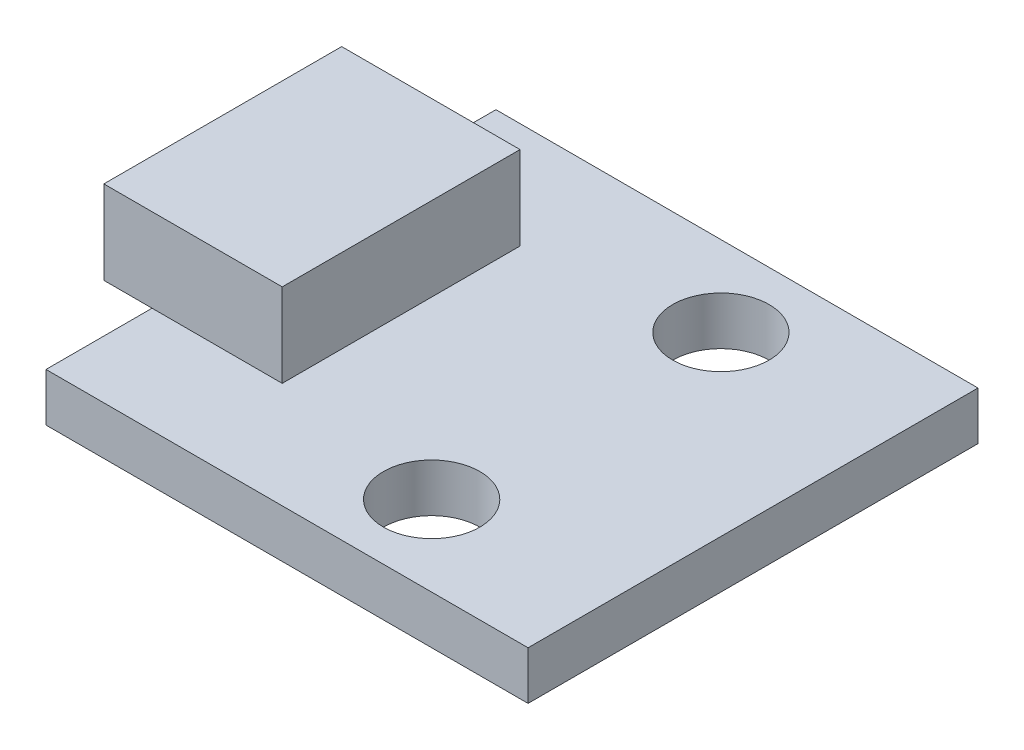
ISO-10303-21;
HEADER;
FILE_DESCRIPTION(('STEP AP214'),'2;1');
FILE_NAME('part.step','',(''),(''),'','','');
FILE_SCHEMA(('AUTOMOTIVE_DESIGN { 1 0 10303 214 1 1 1 1 }'));
ENDSEC;
DATA;
#1=APPLICATION_CONTEXT('core data for automotive mechanical design processes');
#2=APPLICATION_PROTOCOL_DEFINITION('international standard','automotive_design',2000,#1);
#3=PRODUCT_CONTEXT('',#1,'mechanical');
#4=PRODUCT('Part','Part','',(#3));
#5=PRODUCT_RELATED_PRODUCT_CATEGORY('part','',(#4));
#6=PRODUCT_DEFINITION_FORMATION('','',#4);
#7=PRODUCT_DEFINITION_CONTEXT('part definition',#1,'design');
#8=PRODUCT_DEFINITION('design','',#6,#7);
#9=PRODUCT_DEFINITION_SHAPE('','',#8);
#10=(LENGTH_UNIT() NAMED_UNIT(*) SI_UNIT(.MILLI.,.METRE.));
#11=(NAMED_UNIT(*) PLANE_ANGLE_UNIT() SI_UNIT($,.RADIAN.));
#12=(NAMED_UNIT(*) SI_UNIT($,.STERADIAN.) SOLID_ANGLE_UNIT());
#13=UNCERTAINTY_MEASURE_WITH_UNIT(LENGTH_MEASURE(1.E-05),#10,'distance_accuracy_value','');
#14=(GEOMETRIC_REPRESENTATION_CONTEXT(3) GLOBAL_UNCERTAINTY_ASSIGNED_CONTEXT((#13)) GLOBAL_UNIT_ASSIGNED_CONTEXT((#10,
#11,#12)) REPRESENTATION_CONTEXT('',''));
#15=CARTESIAN_POINT('',(0.,0.,0.));
#16=DIRECTION('',(0.,0.,1.));
#17=DIRECTION('',(1.,0.,0.));
#18=AXIS2_PLACEMENT_3D('',#15,#16,#17);
#19=CARTESIAN_POINT('',(0.,1.5,0.));
#20=DIRECTION('',(0.,1.,0.));
#21=DIRECTION('',(0.,0.,1.));
#22=AXIS2_PLACEMENT_3D('',#19,#20,#21);
#23=PLANE('',#22);
#24=CARTESIAN_POINT('',(2.,1.5,-4.5));
#25=DIRECTION('',(0.,1.,0.));
#26=DIRECTION('',(0.,0.,1.));
#27=AXIS2_PLACEMENT_3D('',#24,#25,#26);
#28=CIRCLE('',#27,1.5);
#29=CARTESIAN_POINT('',(2.,1.5,-3.));
#30=VERTEX_POINT('',#29);
#31=EDGE_CURVE('E208',#30,#30,#28,.T.);
#32=ORIENTED_EDGE('',*,*,#31,.F.);
#33=EDGE_LOOP('',(#32));
#34=FACE_BOUND('',#33,.T.);
#35=CARTESIAN_POINT('',(2.,1.5,4.5));
#36=DIRECTION('',(0.,1.,0.));
#37=DIRECTION('',(0.,0.,1.));
#38=AXIS2_PLACEMENT_3D('',#35,#36,#37);
#39=CIRCLE('',#38,1.5);
#40=CARTESIAN_POINT('',(2.,1.5,6.));
#41=VERTEX_POINT('',#40);
#42=EDGE_CURVE('E212',#41,#41,#39,.T.);
#43=ORIENTED_EDGE('',*,*,#42,.F.);
#44=EDGE_LOOP('',(#43));
#45=FACE_BOUND('',#44,.T.);
#46=DIRECTION('',(0.,0.,1.));
#47=VECTOR('',#46,1.);
#48=CARTESIAN_POINT('',(-7.5,1.5,0.));
#49=LINE('',#48,#47);
#50=CARTESIAN_POINT('',(-7.5,1.5,-7.));
#51=VERTEX_POINT('',#50);
#52=CARTESIAN_POINT('',(-7.5,1.5,-3.7));
#53=VERTEX_POINT('',#52);
#54=EDGE_CURVE('E196',#51,#53,#49,.T.);
#55=ORIENTED_EDGE('',*,*,#54,.T.);
#56=DIRECTION('',(1.,0.,0.));
#57=VECTOR('',#56,1.);
#58=CARTESIAN_POINT('',(0.,1.5,-3.7));
#59=LINE('',#58,#57);
#60=CARTESIAN_POINT('',(-3.45,1.5,-3.7));
#61=VERTEX_POINT('',#60);
#62=EDGE_CURVE('E12',#53,#61,#59,.T.);
#63=ORIENTED_EDGE('',*,*,#62,.T.);
#64=DIRECTION('',(0.,0.,-1.));
#65=VECTOR('',#64,1.);
#66=CARTESIAN_POINT('',(-3.45,1.5,0.));
#67=LINE('',#66,#65);
#68=CARTESIAN_POINT('',(-3.45,1.5,3.7));
#69=VERTEX_POINT('',#68);
#70=EDGE_CURVE('E152',#69,#61,#67,.T.);
#71=ORIENTED_EDGE('',*,*,#70,.F.);
#72=DIRECTION('',(1.,0.,0.));
#73=VECTOR('',#72,1.);
#74=CARTESIAN_POINT('',(0.,1.5,3.7));
#75=LINE('',#74,#73);
#76=CARTESIAN_POINT('',(-7.5,1.5,3.7));
#77=VERTEX_POINT('',#76);
#78=EDGE_CURVE('E75',#77,#69,#75,.T.);
#79=ORIENTED_EDGE('',*,*,#78,.F.);
#80=CARTESIAN_POINT('',(-7.5,1.5,7.));
#81=VERTEX_POINT('',#80);
#82=EDGE_CURVE('E194',#77,#81,#49,.T.);
#83=ORIENTED_EDGE('',*,*,#82,.T.);
#84=DIRECTION('',(-1.,0.,0.));
#85=VECTOR('',#84,1.);
#86=CARTESIAN_POINT('',(0.,1.5,7.));
#87=LINE('',#86,#85);
#88=CARTESIAN_POINT('',(7.5,1.5,7.));
#89=VERTEX_POINT('',#88);
#90=EDGE_CURVE('E199',#89,#81,#87,.T.);
#91=ORIENTED_EDGE('',*,*,#90,.F.);
#92=DIRECTION('',(0.,0.,1.));
#93=VECTOR('',#92,1.);
#94=CARTESIAN_POINT('',(7.5,1.5,0.));
#95=LINE('',#94,#93);
#96=CARTESIAN_POINT('',(7.5,1.5,-7.));
#97=VERTEX_POINT('',#96);
#98=EDGE_CURVE('E204',#97,#89,#95,.T.);
#99=ORIENTED_EDGE('',*,*,#98,.F.);
#100=DIRECTION('',(-1.,0.,0.));
#101=VECTOR('',#100,1.);
#102=CARTESIAN_POINT('',(0.,1.5,-7.));
#103=LINE('',#102,#101);
#104=EDGE_CURVE('E190',#97,#51,#103,.T.);
#105=ORIENTED_EDGE('',*,*,#104,.T.);
#106=EDGE_LOOP('',(#55,#63,#71,#79,#83,#91,#99,#105));
#107=FACE_BOUND('',#106,.T.);
#108=ADVANCED_FACE('F65',(#34,#45,#107),#23,.T.);
#109=CARTESIAN_POINT('',(0.,1.5,-7.));
#110=DIRECTION('',(0.,0.,1.));
#111=DIRECTION('',(1.,0.,0.));
#112=AXIS2_PLACEMENT_3D('',#109,#110,#111);
#113=PLANE('',#112);
#114=DIRECTION('',(-1.,0.,0.));
#115=VECTOR('',#114,1.);
#116=CARTESIAN_POINT('',(0.,0.,-7.));
#117=LINE('',#116,#115);
#118=CARTESIAN_POINT('',(7.5,0.,-7.));
#119=VERTEX_POINT('',#118);
#120=CARTESIAN_POINT('',(-7.5,0.,-7.));
#121=VERTEX_POINT('',#120);
#122=EDGE_CURVE('E175',#119,#121,#117,.T.);
#123=ORIENTED_EDGE('',*,*,#122,.T.);
#124=DIRECTION('',(0.,-1.,0.));
#125=VECTOR('',#124,1.);
#126=CARTESIAN_POINT('',(-7.5,1.5,-7.));
#127=LINE('',#126,#125);
#128=EDGE_CURVE('E69',#51,#121,#127,.T.);
#129=ORIENTED_EDGE('',*,*,#128,.F.);
#130=ORIENTED_EDGE('',*,*,#104,.F.);
#131=DIRECTION('',(0.,-1.,0.));
#132=VECTOR('',#131,1.);
#133=CARTESIAN_POINT('',(7.5,1.5,-7.));
#134=LINE('',#133,#132);
#135=EDGE_CURVE('E216',#97,#119,#134,.T.);
#136=ORIENTED_EDGE('',*,*,#135,.T.);
#137=EDGE_LOOP('',(#123,#129,#130,#136));
#138=FACE_BOUND('',#137,.T.);
#139=ADVANCED_FACE('F67',(#138),#113,.F.);
#140=CARTESIAN_POINT('',(-7.5,1.5,0.));
#141=DIRECTION('',(1.,0.,0.));
#142=DIRECTION('',(0.,0.,-1.));
#143=AXIS2_PLACEMENT_3D('',#140,#141,#142);
#144=PLANE('',#143);
#145=DIRECTION('',(0.,0.,1.));
#146=VECTOR('',#145,1.);
#147=CARTESIAN_POINT('',(-7.5,0.,0.));
#148=LINE('',#147,#146);
#149=CARTESIAN_POINT('',(-7.5,0.,7.));
#150=VERTEX_POINT('',#149);
#151=EDGE_CURVE('E220',#121,#150,#148,.T.);
#152=ORIENTED_EDGE('',*,*,#151,.T.);
#153=DIRECTION('',(0.,-1.,0.));
#154=VECTOR('',#153,1.);
#155=CARTESIAN_POINT('',(-7.5,1.5,7.));
#156=LINE('',#155,#154);
#157=EDGE_CURVE('E243',#81,#150,#156,.T.);
#158=ORIENTED_EDGE('',*,*,#157,.F.);
#159=ORIENTED_EDGE('',*,*,#82,.F.);
#160=EDGE_CURVE('E200',#53,#77,#49,.T.);
#161=ORIENTED_EDGE('',*,*,#160,.F.);
#162=ORIENTED_EDGE('',*,*,#54,.F.);
#163=ORIENTED_EDGE('',*,*,#128,.T.);
#164=EDGE_LOOP('',(#152,#158,#159,#161,#162,#163));
#165=FACE_BOUND('',#164,.T.);
#166=ADVANCED_FACE('F264',(#165),#144,.F.);
#167=CARTESIAN_POINT('',(0.,1.5,7.));
#168=DIRECTION('',(0.,0.,1.));
#169=DIRECTION('',(1.,0.,0.));
#170=AXIS2_PLACEMENT_3D('',#167,#168,#169);
#171=PLANE('',#170);
#172=DIRECTION('',(-1.,0.,0.));
#173=VECTOR('',#172,1.);
#174=CARTESIAN_POINT('',(0.,0.,7.));
#175=LINE('',#174,#173);
#176=CARTESIAN_POINT('',(7.5,0.,7.));
#177=VERTEX_POINT('',#176);
#178=EDGE_CURVE('E224',#177,#150,#175,.T.);
#179=ORIENTED_EDGE('',*,*,#178,.F.);
#180=DIRECTION('',(0.,-1.,0.));
#181=VECTOR('',#180,1.);
#182=CARTESIAN_POINT('',(7.5,1.5,7.));
#183=LINE('',#182,#181);
#184=EDGE_CURVE('E241',#89,#177,#183,.T.);
#185=ORIENTED_EDGE('',*,*,#184,.F.);
#186=ORIENTED_EDGE('',*,*,#90,.T.);
#187=ORIENTED_EDGE('',*,*,#157,.T.);
#188=EDGE_LOOP('',(#179,#185,#186,#187));
#189=FACE_BOUND('',#188,.T.);
#190=ADVANCED_FACE('F265',(#189),#171,.T.);
#191=CARTESIAN_POINT('',(2.,1.5,-4.5));
#192=DIRECTION('',(0.,-1.,0.));
#193=DIRECTION('',(0.,0.,-1.));
#194=AXIS2_PLACEMENT_3D('',#191,#192,#193);
#195=CYLINDRICAL_SURFACE('',#194,1.5);
#196=ORIENTED_EDGE('',*,*,#31,.T.);
#197=EDGE_LOOP('',(#196));
#198=FACE_BOUND('',#197,.T.);
#199=CARTESIAN_POINT('',(2.,0.,-4.5));
#200=DIRECTION('',(0.,1.,0.));
#201=DIRECTION('',(0.,0.,1.));
#202=AXIS2_PLACEMENT_3D('',#199,#200,#201);
#203=CIRCLE('',#202,1.5);
#204=CARTESIAN_POINT('',(2.,0.,-3.));
#205=VERTEX_POINT('',#204);
#206=EDGE_CURVE('E232',#205,#205,#203,.T.);
#207=ORIENTED_EDGE('',*,*,#206,.F.);
#208=EDGE_LOOP('',(#207));
#209=FACE_BOUND('',#208,.T.);
#210=ADVANCED_FACE('F288',(#198,#209),#195,.F.);
#211=CARTESIAN_POINT('',(7.5,1.5,0.));
#212=DIRECTION('',(1.,0.,0.));
#213=DIRECTION('',(0.,0.,-1.));
#214=AXIS2_PLACEMENT_3D('',#211,#212,#213);
#215=PLANE('',#214);
#216=DIRECTION('',(0.,0.,1.));
#217=VECTOR('',#216,1.);
#218=CARTESIAN_POINT('',(7.5,0.,0.));
#219=LINE('',#218,#217);
#220=EDGE_CURVE('E228',#119,#177,#219,.T.);
#221=ORIENTED_EDGE('',*,*,#220,.F.);
#222=ORIENTED_EDGE('',*,*,#135,.F.);
#223=ORIENTED_EDGE('',*,*,#98,.T.);
#224=ORIENTED_EDGE('',*,*,#184,.T.);
#225=EDGE_LOOP('',(#221,#222,#223,#224));
#226=FACE_BOUND('',#225,.T.);
#227=ADVANCED_FACE('F268',(#226),#215,.T.);
#228=CARTESIAN_POINT('',(2.,1.5,4.5));
#229=DIRECTION('',(0.,-1.,0.));
#230=DIRECTION('',(0.,0.,-1.));
#231=AXIS2_PLACEMENT_3D('',#228,#229,#230);
#232=CYLINDRICAL_SURFACE('',#231,1.5);
#233=ORIENTED_EDGE('',*,*,#42,.T.);
#234=EDGE_LOOP('',(#233));
#235=FACE_BOUND('',#234,.T.);
#236=CARTESIAN_POINT('',(2.,0.,4.5));
#237=DIRECTION('',(0.,1.,0.));
#238=DIRECTION('',(0.,0.,1.));
#239=AXIS2_PLACEMENT_3D('',#236,#237,#238);
#240=CIRCLE('',#239,1.5);
#241=CARTESIAN_POINT('',(2.,0.,6.));
#242=VERTEX_POINT('',#241);
#243=EDGE_CURVE('E195',#242,#242,#240,.T.);
#244=ORIENTED_EDGE('',*,*,#243,.F.);
#245=EDGE_LOOP('',(#244));
#246=FACE_BOUND('',#245,.T.);
#247=ADVANCED_FACE('F276',(#235,#246),#232,.F.);
#248=CARTESIAN_POINT('',(0.,0.,0.));
#249=DIRECTION('',(0.,1.,0.));
#250=DIRECTION('',(0.,0.,1.));
#251=AXIS2_PLACEMENT_3D('',#248,#249,#250);
#252=PLANE('',#251);
#253=ORIENTED_EDGE('',*,*,#122,.F.);
#254=ORIENTED_EDGE('',*,*,#220,.T.);
#255=ORIENTED_EDGE('',*,*,#178,.T.);
#256=ORIENTED_EDGE('',*,*,#151,.F.);
#257=EDGE_LOOP('',(#253,#254,#255,#256));
#258=FACE_BOUND('',#257,.T.);
#259=ORIENTED_EDGE('',*,*,#206,.T.);
#260=EDGE_LOOP('',(#259));
#261=FACE_BOUND('',#260,.T.);
#262=ORIENTED_EDGE('',*,*,#243,.T.);
#263=EDGE_LOOP('',(#262));
#264=FACE_BOUND('',#263,.T.);
#265=ADVANCED_FACE('F273',(#258,#261,#264),#252,.F.);
#266=CARTESIAN_POINT('',(0.,1.5,0.));
#267=DIRECTION('',(0.,1.,0.));
#268=DIRECTION('',(0.,0.,1.));
#269=AXIS2_PLACEMENT_3D('',#266,#267,#268);
#270=PLANE('',#269);
#271=CARTESIAN_POINT('',(-9.,1.5,-3.7));
#272=VERTEX_POINT('',#271);
#273=EDGE_CURVE('E77',#272,#53,#59,.T.);
#274=ORIENTED_EDGE('',*,*,#273,.T.);
#275=ORIENTED_EDGE('',*,*,#160,.T.);
#276=CARTESIAN_POINT('',(-9.,1.5,3.7));
#277=VERTEX_POINT('',#276);
#278=EDGE_CURVE('E162',#277,#77,#75,.T.);
#279=ORIENTED_EDGE('',*,*,#278,.F.);
#280=DIRECTION('',(0.,0.,-1.));
#281=VECTOR('',#280,1.);
#282=CARTESIAN_POINT('',(-9.,1.5,0.));
#283=LINE('',#282,#281);
#284=EDGE_CURVE('E181',#277,#272,#283,.T.);
#285=ORIENTED_EDGE('',*,*,#284,.T.);
#286=EDGE_LOOP('',(#274,#275,#279,#285));
#287=FACE_BOUND('',#286,.T.);
#288=ADVANCED_FACE('F259',(#287),#270,.F.);
#289=CARTESIAN_POINT('',(0.,4.1,-3.7));
#290=DIRECTION('',(0.,0.,-1.));
#291=DIRECTION('',(-1.,0.,0.));
#292=AXIS2_PLACEMENT_3D('',#289,#290,#291);
#293=PLANE('',#292);
#294=ORIENTED_EDGE('',*,*,#273,.F.);
#295=DIRECTION('',(0.,-1.,0.));
#296=VECTOR('',#295,1.);
#297=CARTESIAN_POINT('',(-9.,4.1,-3.7));
#298=LINE('',#297,#296);
#299=CARTESIAN_POINT('',(-9.,4.1,-3.7));
#300=VERTEX_POINT('',#299);
#301=EDGE_CURVE('E159',#300,#272,#298,.T.);
#302=ORIENTED_EDGE('',*,*,#301,.F.);
#303=DIRECTION('',(1.,0.,0.));
#304=VECTOR('',#303,1.);
#305=CARTESIAN_POINT('',(0.,4.1,-3.7));
#306=LINE('',#305,#304);
#307=CARTESIAN_POINT('',(-3.45,4.1,-3.7));
#308=VERTEX_POINT('',#307);
#309=EDGE_CURVE('E141',#300,#308,#306,.T.);
#310=ORIENTED_EDGE('',*,*,#309,.T.);
#311=DIRECTION('',(0.,-1.,0.));
#312=VECTOR('',#311,1.);
#313=CARTESIAN_POINT('',(-3.45,4.1,-3.7));
#314=LINE('',#313,#312);
#315=EDGE_CURVE('E150',#308,#61,#314,.T.);
#316=ORIENTED_EDGE('',*,*,#315,.T.);
#317=ORIENTED_EDGE('',*,*,#62,.F.);
#318=EDGE_LOOP('',(#294,#302,#310,#316,#317));
#319=FACE_BOUND('',#318,.T.);
#320=ADVANCED_FACE('F157',(#319),#293,.T.);
#321=CARTESIAN_POINT('',(-3.45,4.1,0.));
#322=DIRECTION('',(-1.,0.,0.));
#323=DIRECTION('',(0.,0.,1.));
#324=AXIS2_PLACEMENT_3D('',#321,#322,#323);
#325=PLANE('',#324);
#326=ORIENTED_EDGE('',*,*,#70,.T.);
#327=ORIENTED_EDGE('',*,*,#315,.F.);
#328=DIRECTION('',(0.,0.,-1.));
#329=VECTOR('',#328,1.);
#330=CARTESIAN_POINT('',(-3.45,4.1,0.));
#331=LINE('',#330,#329);
#332=CARTESIAN_POINT('',(-3.45,4.1,3.7));
#333=VERTEX_POINT('',#332);
#334=EDGE_CURVE('E136',#333,#308,#331,.T.);
#335=ORIENTED_EDGE('',*,*,#334,.F.);
#336=DIRECTION('',(0.,-1.,0.));
#337=VECTOR('',#336,1.);
#338=CARTESIAN_POINT('',(-3.45,4.1,3.7));
#339=LINE('',#338,#337);
#340=EDGE_CURVE('E155',#333,#69,#339,.T.);
#341=ORIENTED_EDGE('',*,*,#340,.T.);
#342=EDGE_LOOP('',(#326,#327,#335,#341));
#343=FACE_BOUND('',#342,.T.);
#344=ADVANCED_FACE('F151',(#343),#325,.F.);
#345=CARTESIAN_POINT('',(0.,4.1,3.7));
#346=DIRECTION('',(0.,0.,-1.));
#347=DIRECTION('',(-1.,0.,0.));
#348=AXIS2_PLACEMENT_3D('',#345,#346,#347);
#349=PLANE('',#348);
#350=ORIENTED_EDGE('',*,*,#278,.T.);
#351=ORIENTED_EDGE('',*,*,#78,.T.);
#352=ORIENTED_EDGE('',*,*,#340,.F.);
#353=DIRECTION('',(1.,0.,0.));
#354=VECTOR('',#353,1.);
#355=CARTESIAN_POINT('',(0.,4.1,3.7));
#356=LINE('',#355,#354);
#357=CARTESIAN_POINT('',(-9.,4.1,3.7));
#358=VERTEX_POINT('',#357);
#359=EDGE_CURVE('E143',#358,#333,#356,.T.);
#360=ORIENTED_EDGE('',*,*,#359,.F.);
#361=DIRECTION('',(0.,-1.,0.));
#362=VECTOR('',#361,1.);
#363=CARTESIAN_POINT('',(-9.,4.1,3.7));
#364=LINE('',#363,#362);
#365=EDGE_CURVE('E180',#358,#277,#364,.T.);
#366=ORIENTED_EDGE('',*,*,#365,.T.);
#367=EDGE_LOOP('',(#350,#351,#352,#360,#366));
#368=FACE_BOUND('',#367,.T.);
#369=ADVANCED_FACE('F254',(#368),#349,.F.);
#370=CARTESIAN_POINT('',(0.,4.1,0.));
#371=DIRECTION('',(0.,1.,0.));
#372=DIRECTION('',(0.,0.,1.));
#373=AXIS2_PLACEMENT_3D('',#370,#371,#372);
#374=PLANE('',#373);
#375=ORIENTED_EDGE('',*,*,#309,.F.);
#376=DIRECTION('',(0.,0.,-1.));
#377=VECTOR('',#376,1.);
#378=CARTESIAN_POINT('',(-9.,4.1,0.));
#379=LINE('',#378,#377);
#380=EDGE_CURVE('E177',#358,#300,#379,.T.);
#381=ORIENTED_EDGE('',*,*,#380,.F.);
#382=ORIENTED_EDGE('',*,*,#359,.T.);
#383=ORIENTED_EDGE('',*,*,#334,.T.);
#384=EDGE_LOOP('',(#375,#381,#382,#383));
#385=FACE_BOUND('',#384,.T.);
#386=ADVANCED_FACE('F138',(#385),#374,.T.);
#387=CARTESIAN_POINT('',(-9.,4.1,0.));
#388=DIRECTION('',(-1.,0.,0.));
#389=DIRECTION('',(0.,0.,1.));
#390=AXIS2_PLACEMENT_3D('',#387,#388,#389);
#391=PLANE('',#390);
#392=ORIENTED_EDGE('',*,*,#284,.F.);
#393=ORIENTED_EDGE('',*,*,#365,.F.);
#394=ORIENTED_EDGE('',*,*,#380,.T.);
#395=ORIENTED_EDGE('',*,*,#301,.T.);
#396=EDGE_LOOP('',(#392,#393,#394,#395));
#397=FACE_BOUND('',#396,.T.);
#398=ADVANCED_FACE('F300',(#397),#391,.T.);
#399=CLOSED_SHELL('',(#108,#139,#166,#190,#210,#227,#247,#265,#288,#320,#344,#369,#386,#398));
#400=MANIFOLD_SOLID_BREP('B2',#399);
#401=ADVANCED_BREP_SHAPE_REPRESENTATION('',(#18,#400),#14);
#402=SHAPE_DEFINITION_REPRESENTATION(#9,#401);
ENDSEC;
END-ISO-10303-21;
